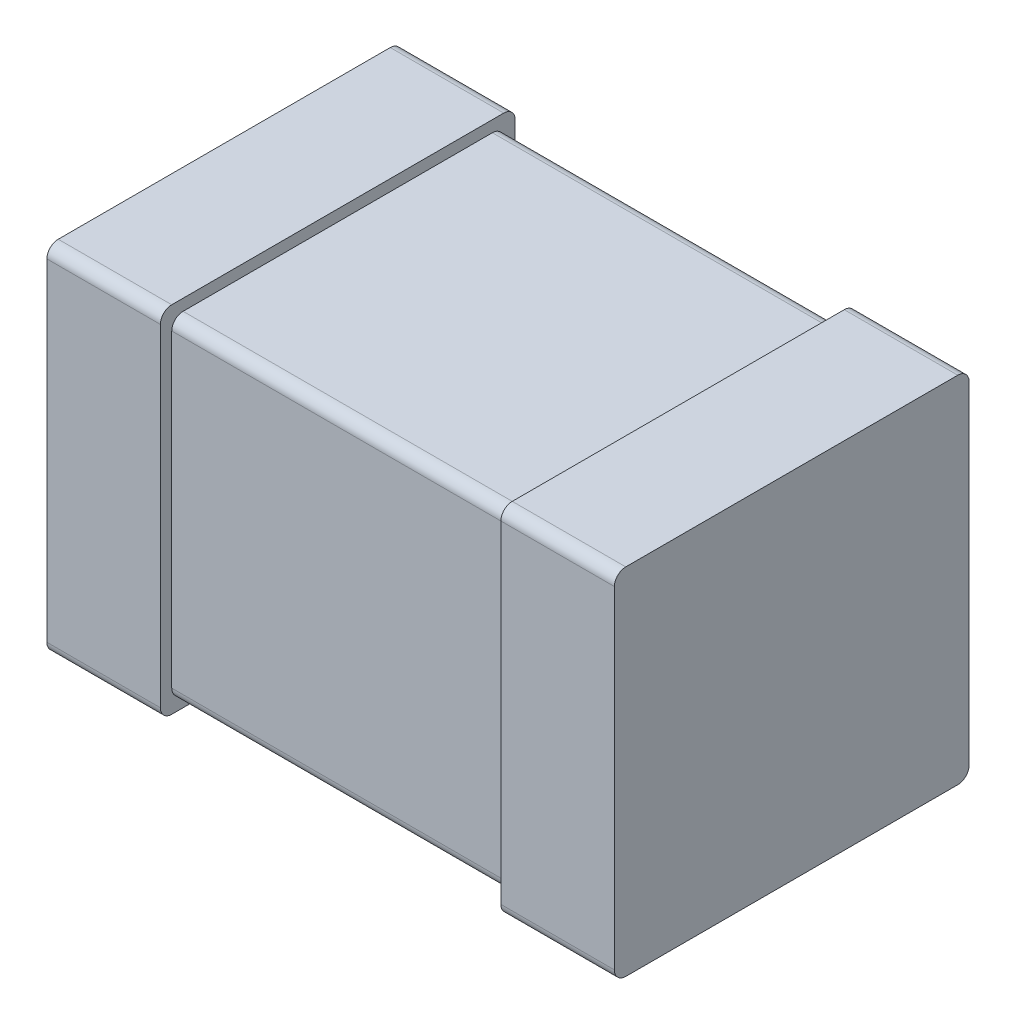
ISO-10303-21;
HEADER;
FILE_DESCRIPTION(('STEP AP214'),'2;1');
FILE_NAME('part.step','',(''),(''),'','','');
FILE_SCHEMA(('AUTOMOTIVE_DESIGN { 1 0 10303 214 1 1 1 1 }'));
ENDSEC;
DATA;
#1=APPLICATION_CONTEXT('core data for automotive mechanical design processes');
#2=APPLICATION_PROTOCOL_DEFINITION('international standard','automotive_design',2000,#1);
#3=PRODUCT_CONTEXT('',#1,'mechanical');
#4=PRODUCT('Part','Part','',(#3));
#5=PRODUCT_RELATED_PRODUCT_CATEGORY('part','',(#4));
#6=PRODUCT_DEFINITION_FORMATION('','',#4);
#7=PRODUCT_DEFINITION_CONTEXT('part definition',#1,'design');
#8=PRODUCT_DEFINITION('design','',#6,#7);
#9=PRODUCT_DEFINITION_SHAPE('','',#8);
#10=(LENGTH_UNIT() NAMED_UNIT(*) SI_UNIT(.MILLI.,.METRE.));
#11=(NAMED_UNIT(*) PLANE_ANGLE_UNIT() SI_UNIT($,.RADIAN.));
#12=(NAMED_UNIT(*) SI_UNIT($,.STERADIAN.) SOLID_ANGLE_UNIT());
#13=UNCERTAINTY_MEASURE_WITH_UNIT(LENGTH_MEASURE(1.E-05),#10,'distance_accuracy_value','');
#14=(GEOMETRIC_REPRESENTATION_CONTEXT(3) GLOBAL_UNCERTAINTY_ASSIGNED_CONTEXT((#13)) GLOBAL_UNIT_ASSIGNED_CONTEXT((#10,
#11,#12)) REPRESENTATION_CONTEXT('',''));
#15=CARTESIAN_POINT('',(0.,0.,0.));
#16=DIRECTION('',(0.,0.,1.));
#17=DIRECTION('',(1.,0.,0.));
#18=AXIS2_PLACEMENT_3D('',#15,#16,#17);
#19=CARTESIAN_POINT('',(-1.,-0.625,0.));
#20=DIRECTION('',(1.,0.,0.));
#21=DIRECTION('',(0.,1.,0.));
#22=AXIS2_PLACEMENT_3D('',#19,#20,#21);
#23=PLANE('',#22);
#24=CARTESIAN_POINT('',(-1.,-0.585,1.21));
#25=DIRECTION('',(-1.,0.,0.));
#26=DIRECTION('',(0.,0.,1.));
#27=AXIS2_PLACEMENT_3D('',#24,#25,#26);
#28=CIRCLE('',#27,0.04);
#29=CARTESIAN_POINT('',(-1.,-0.625,1.21));
#30=VERTEX_POINT('',#29);
#31=CARTESIAN_POINT('',(-1.,-0.585,1.25));
#32=VERTEX_POINT('',#31);
#33=EDGE_CURVE('E11',#30,#32,#28,.T.);
#34=ORIENTED_EDGE('',*,*,#33,.T.);
#35=DIRECTION('',(0.,1.,0.));
#36=VECTOR('',#35,1.);
#37=CARTESIAN_POINT('',(-1.,-0.625,1.25));
#38=LINE('',#37,#36);
#39=CARTESIAN_POINT('',(-1.,0.585,1.25));
#40=VERTEX_POINT('',#39);
#41=EDGE_CURVE('E27',#32,#40,#38,.T.);
#42=ORIENTED_EDGE('',*,*,#41,.T.);
#43=CARTESIAN_POINT('',(-1.,0.585,1.21));
#44=DIRECTION('',(1.,0.,0.));
#45=DIRECTION('',(0.,0.,1.));
#46=AXIS2_PLACEMENT_3D('',#43,#44,#45);
#47=CIRCLE('',#46,0.04);
#48=CARTESIAN_POINT('',(-1.,0.625,1.21));
#49=VERTEX_POINT('',#48);
#50=EDGE_CURVE('E290',#49,#40,#47,.T.);
#51=ORIENTED_EDGE('',*,*,#50,.F.);
#52=DIRECTION('',(0.,0.,1.));
#53=VECTOR('',#52,1.);
#54=CARTESIAN_POINT('',(-1.,0.625,0.));
#55=LINE('',#54,#53);
#56=CARTESIAN_POINT('',(-1.,0.625,0.04));
#57=VERTEX_POINT('',#56);
#58=EDGE_CURVE('E332',#57,#49,#55,.T.);
#59=ORIENTED_EDGE('',*,*,#58,.F.);
#60=CARTESIAN_POINT('',(-1.,0.585,0.04));
#61=DIRECTION('',(-1.,0.,0.));
#62=DIRECTION('',(0.,0.,1.));
#63=AXIS2_PLACEMENT_3D('',#60,#61,#62);
#64=CIRCLE('',#63,0.04);
#65=CARTESIAN_POINT('',(-1.,0.585,0.));
#66=VERTEX_POINT('',#65);
#67=EDGE_CURVE('E268',#57,#66,#64,.T.);
#68=ORIENTED_EDGE('',*,*,#67,.T.);
#69=DIRECTION('',(0.,1.,0.));
#70=VECTOR('',#69,1.);
#71=CARTESIAN_POINT('',(-1.,-0.625,0.));
#72=LINE('',#71,#70);
#73=CARTESIAN_POINT('',(-1.,-0.585,0.));
#74=VERTEX_POINT('',#73);
#75=EDGE_CURVE('E298',#74,#66,#72,.T.);
#76=ORIENTED_EDGE('',*,*,#75,.F.);
#77=CARTESIAN_POINT('',(-1.,-0.585,0.04));
#78=DIRECTION('',(1.,0.,0.));
#79=DIRECTION('',(0.,0.,1.));
#80=AXIS2_PLACEMENT_3D('',#77,#78,#79);
#81=CIRCLE('',#80,0.04);
#82=CARTESIAN_POINT('',(-1.,-0.625,0.04));
#83=VERTEX_POINT('',#82);
#84=EDGE_CURVE('E284',#83,#74,#81,.T.);
#85=ORIENTED_EDGE('',*,*,#84,.F.);
#86=DIRECTION('',(0.,0.,1.));
#87=VECTOR('',#86,1.);
#88=CARTESIAN_POINT('',(-1.,-0.625,0.));
#89=LINE('',#88,#87);
#90=EDGE_CURVE('E264',#83,#30,#89,.T.);
#91=ORIENTED_EDGE('',*,*,#90,.T.);
#92=EDGE_LOOP('',(#34,#42,#51,#59,#68,#76,#85,#91));
#93=FACE_BOUND('',#92,.T.);
#94=ADVANCED_FACE('F16',(#93),#23,.F.);
#95=CARTESIAN_POINT('',(-1.,-0.625,0.));
#96=DIRECTION('',(0.,1.,0.));
#97=DIRECTION('',(1.,0.,0.));
#98=AXIS2_PLACEMENT_3D('',#95,#96,#97);
#99=PLANE('',#98);
#100=DIRECTION('',(1.,0.,0.));
#101=VECTOR('',#100,1.);
#102=CARTESIAN_POINT('',(-1.,-0.625,1.21));
#103=LINE('',#102,#101);
#104=CARTESIAN_POINT('',(-0.6,-0.625,1.21));
#105=VERTEX_POINT('',#104);
#106=EDGE_CURVE('E306',#30,#105,#103,.T.);
#107=ORIENTED_EDGE('',*,*,#106,.F.);
#108=ORIENTED_EDGE('',*,*,#90,.F.);
#109=DIRECTION('',(1.,0.,0.));
#110=VECTOR('',#109,1.);
#111=CARTESIAN_POINT('',(-1.,-0.625,0.04));
#112=LINE('',#111,#110);
#113=CARTESIAN_POINT('',(-0.6,-0.625,0.04));
#114=VERTEX_POINT('',#113);
#115=EDGE_CURVE('E269',#83,#114,#112,.T.);
#116=ORIENTED_EDGE('',*,*,#115,.T.);
#117=DIRECTION('',(0.,0.,1.));
#118=VECTOR('',#117,1.);
#119=CARTESIAN_POINT('',(-0.6,-0.625,0.));
#120=LINE('',#119,#118);
#121=EDGE_CURVE('E288',#114,#105,#120,.T.);
#122=ORIENTED_EDGE('',*,*,#121,.T.);
#123=EDGE_LOOP('',(#107,#108,#116,#122));
#124=FACE_BOUND('',#123,.T.);
#125=ADVANCED_FACE('F423',(#124),#99,.F.);
#126=CARTESIAN_POINT('',(-1.,-0.585,0.04));
#127=DIRECTION('',(1.,0.,0.));
#128=DIRECTION('',(0.,-1.,0.));
#129=AXIS2_PLACEMENT_3D('',#126,#127,#128);
#130=CYLINDRICAL_SURFACE('',#129,0.04);
#131=ORIENTED_EDGE('',*,*,#84,.T.);
#132=DIRECTION('',(1.,0.,0.));
#133=VECTOR('',#132,1.);
#134=CARTESIAN_POINT('',(-1.,-0.585,0.));
#135=LINE('',#134,#133);
#136=CARTESIAN_POINT('',(-0.6,-0.585,0.));
#137=VERTEX_POINT('',#136);
#138=EDGE_CURVE('E289',#74,#137,#135,.T.);
#139=ORIENTED_EDGE('',*,*,#138,.T.);
#140=CARTESIAN_POINT('',(-0.6,-0.585,0.04));
#141=DIRECTION('',(1.,0.,0.));
#142=DIRECTION('',(0.,0.,1.));
#143=AXIS2_PLACEMENT_3D('',#140,#141,#142);
#144=CIRCLE('',#143,0.04);
#145=EDGE_CURVE('E330',#114,#137,#144,.T.);
#146=ORIENTED_EDGE('',*,*,#145,.F.);
#147=ORIENTED_EDGE('',*,*,#115,.F.);
#148=EDGE_LOOP('',(#131,#139,#146,#147));
#149=FACE_BOUND('',#148,.T.);
#150=ADVANCED_FACE('F409',(#149),#130,.T.);
#151=CARTESIAN_POINT('',(-1.,-0.585,1.21));
#152=DIRECTION('',(1.,0.,0.));
#153=DIRECTION('',(0.,-1.,0.));
#154=AXIS2_PLACEMENT_3D('',#151,#152,#153);
#155=CYLINDRICAL_SURFACE('',#154,0.04);
#156=ORIENTED_EDGE('',*,*,#106,.T.);
#157=CARTESIAN_POINT('',(-0.6,-0.585,1.21));
#158=DIRECTION('',(-1.,0.,0.));
#159=DIRECTION('',(0.,0.,1.));
#160=AXIS2_PLACEMENT_3D('',#157,#158,#159);
#161=CIRCLE('',#160,0.04);
#162=CARTESIAN_POINT('',(-0.6,-0.585,1.25));
#163=VERTEX_POINT('',#162);
#164=EDGE_CURVE('E303',#105,#163,#161,.T.);
#165=ORIENTED_EDGE('',*,*,#164,.T.);
#166=DIRECTION('',(1.,0.,0.));
#167=VECTOR('',#166,1.);
#168=CARTESIAN_POINT('',(-1.,-0.585,1.25));
#169=LINE('',#168,#167);
#170=EDGE_CURVE('E302',#32,#163,#169,.T.);
#171=ORIENTED_EDGE('',*,*,#170,.F.);
#172=ORIENTED_EDGE('',*,*,#33,.F.);
#173=EDGE_LOOP('',(#156,#165,#171,#172));
#174=FACE_BOUND('',#173,.T.);
#175=ADVANCED_FACE('F588',(#174),#155,.T.);
#176=CARTESIAN_POINT('',(-1.,-0.625,0.));
#177=DIRECTION('',(0.,0.,1.));
#178=DIRECTION('',(1.,0.,0.));
#179=AXIS2_PLACEMENT_3D('',#176,#177,#178);
#180=PLANE('',#179);
#181=DIRECTION('',(1.,0.,0.));
#182=VECTOR('',#181,1.);
#183=CARTESIAN_POINT('',(-1.,0.585,0.));
#184=LINE('',#183,#182);
#185=CARTESIAN_POINT('',(-0.6,0.585,0.));
#186=VERTEX_POINT('',#185);
#187=EDGE_CURVE('E301',#66,#186,#184,.T.);
#188=ORIENTED_EDGE('',*,*,#187,.T.);
#189=DIRECTION('',(0.,1.,0.));
#190=VECTOR('',#189,1.);
#191=CARTESIAN_POINT('',(-0.6,-0.625,0.));
#192=LINE('',#191,#190);
#193=EDGE_CURVE('E328',#137,#186,#192,.T.);
#194=ORIENTED_EDGE('',*,*,#193,.F.);
#195=ORIENTED_EDGE('',*,*,#138,.F.);
#196=ORIENTED_EDGE('',*,*,#75,.T.);
#197=EDGE_LOOP('',(#188,#194,#195,#196));
#198=FACE_BOUND('',#197,.T.);
#199=ADVANCED_FACE('F414',(#198),#180,.F.);
#200=CARTESIAN_POINT('',(-1.,-0.625,1.25));
#201=DIRECTION('',(0.,0.,1.));
#202=DIRECTION('',(1.,0.,0.));
#203=AXIS2_PLACEMENT_3D('',#200,#201,#202);
#204=PLANE('',#203);
#205=ORIENTED_EDGE('',*,*,#41,.F.);
#206=ORIENTED_EDGE('',*,*,#170,.T.);
#207=DIRECTION('',(0.,1.,0.));
#208=VECTOR('',#207,1.);
#209=CARTESIAN_POINT('',(-0.6,-0.625,1.25));
#210=LINE('',#209,#208);
#211=CARTESIAN_POINT('',(-0.6,0.585,1.25));
#212=VERTEX_POINT('',#211);
#213=EDGE_CURVE('E489',#163,#212,#210,.T.);
#214=ORIENTED_EDGE('',*,*,#213,.T.);
#215=DIRECTION('',(1.,0.,0.));
#216=VECTOR('',#215,1.);
#217=CARTESIAN_POINT('',(-1.,0.585,1.25));
#218=LINE('',#217,#216);
#219=EDGE_CURVE('E294',#40,#212,#218,.T.);
#220=ORIENTED_EDGE('',*,*,#219,.F.);
#221=EDGE_LOOP('',(#205,#206,#214,#220));
#222=FACE_BOUND('',#221,.T.);
#223=ADVANCED_FACE('F533',(#222),#204,.T.);
#224=CARTESIAN_POINT('',(-1.,0.585,0.04));
#225=DIRECTION('',(1.,0.,0.));
#226=DIRECTION('',(0.,1.,0.));
#227=AXIS2_PLACEMENT_3D('',#224,#225,#226);
#228=CYLINDRICAL_SURFACE('',#227,0.04);
#229=DIRECTION('',(1.,0.,0.));
#230=VECTOR('',#229,1.);
#231=CARTESIAN_POINT('',(-1.,0.625,0.04));
#232=LINE('',#231,#230);
#233=CARTESIAN_POINT('',(-0.6,0.625,0.04));
#234=VERTEX_POINT('',#233);
#235=EDGE_CURVE('E394',#57,#234,#232,.T.);
#236=ORIENTED_EDGE('',*,*,#235,.T.);
#237=CARTESIAN_POINT('',(-0.6,0.585,0.04));
#238=DIRECTION('',(-1.,0.,0.));
#239=DIRECTION('',(0.,0.,1.));
#240=AXIS2_PLACEMENT_3D('',#237,#238,#239);
#241=CIRCLE('',#240,0.04);
#242=EDGE_CURVE('E293',#234,#186,#241,.T.);
#243=ORIENTED_EDGE('',*,*,#242,.T.);
#244=ORIENTED_EDGE('',*,*,#187,.F.);
#245=ORIENTED_EDGE('',*,*,#67,.F.);
#246=EDGE_LOOP('',(#236,#243,#244,#245));
#247=FACE_BOUND('',#246,.T.);
#248=ADVANCED_FACE('F542',(#247),#228,.T.);
#249=CARTESIAN_POINT('',(-1.,0.585,1.21));
#250=DIRECTION('',(1.,0.,0.));
#251=DIRECTION('',(0.,1.,0.));
#252=AXIS2_PLACEMENT_3D('',#249,#250,#251);
#253=CYLINDRICAL_SURFACE('',#252,0.04);
#254=ORIENTED_EDGE('',*,*,#50,.T.);
#255=ORIENTED_EDGE('',*,*,#219,.T.);
#256=CARTESIAN_POINT('',(-0.6,0.585,1.21));
#257=DIRECTION('',(1.,0.,0.));
#258=DIRECTION('',(0.,0.,1.));
#259=AXIS2_PLACEMENT_3D('',#256,#257,#258);
#260=CIRCLE('',#259,0.04);
#261=CARTESIAN_POINT('',(-0.6,0.625,1.21));
#262=VERTEX_POINT('',#261);
#263=EDGE_CURVE('E214',#262,#212,#260,.T.);
#264=ORIENTED_EDGE('',*,*,#263,.F.);
#265=DIRECTION('',(1.,0.,0.));
#266=VECTOR('',#265,1.);
#267=CARTESIAN_POINT('',(-1.,0.625,1.21));
#268=LINE('',#267,#266);
#269=EDGE_CURVE('E335',#49,#262,#268,.T.);
#270=ORIENTED_EDGE('',*,*,#269,.F.);
#271=EDGE_LOOP('',(#254,#255,#264,#270));
#272=FACE_BOUND('',#271,.T.);
#273=ADVANCED_FACE('F535',(#272),#253,.T.);
#274=CARTESIAN_POINT('',(-1.,0.625,0.));
#275=DIRECTION('',(0.,1.,0.));
#276=DIRECTION('',(1.,0.,0.));
#277=AXIS2_PLACEMENT_3D('',#274,#275,#276);
#278=PLANE('',#277);
#279=DIRECTION('',(0.,0.,1.));
#280=VECTOR('',#279,1.);
#281=CARTESIAN_POINT('',(-0.6,0.625,0.));
#282=LINE('',#281,#280);
#283=EDGE_CURVE('E331',#234,#262,#282,.T.);
#284=ORIENTED_EDGE('',*,*,#283,.F.);
#285=ORIENTED_EDGE('',*,*,#235,.F.);
#286=ORIENTED_EDGE('',*,*,#58,.T.);
#287=ORIENTED_EDGE('',*,*,#269,.T.);
#288=EDGE_LOOP('',(#284,#285,#286,#287));
#289=FACE_BOUND('',#288,.T.);
#290=ADVANCED_FACE('F538',(#289),#278,.T.);
#291=CARTESIAN_POINT('',(-0.6,-0.625,0.));
#292=DIRECTION('',(1.,0.,0.));
#293=DIRECTION('',(0.,1.,0.));
#294=AXIS2_PLACEMENT_3D('',#291,#292,#293);
#295=PLANE('',#294);
#296=ORIENTED_EDGE('',*,*,#121,.F.);
#297=ORIENTED_EDGE('',*,*,#145,.T.);
#298=ORIENTED_EDGE('',*,*,#193,.T.);
#299=ORIENTED_EDGE('',*,*,#242,.F.);
#300=ORIENTED_EDGE('',*,*,#283,.T.);
#301=ORIENTED_EDGE('',*,*,#263,.T.);
#302=ORIENTED_EDGE('',*,*,#213,.F.);
#303=ORIENTED_EDGE('',*,*,#164,.F.);
#304=EDGE_LOOP('',(#296,#297,#298,#299,#300,#301,#302,#303));
#305=FACE_BOUND('',#304,.T.);
#306=CARTESIAN_POINT('',(-0.6,-0.545,0.08));
#307=DIRECTION('',(1.,0.,0.));
#308=DIRECTION('',(0.,0.,1.));
#309=AXIS2_PLACEMENT_3D('',#306,#307,#308);
#310=CIRCLE('',#309,0.04);
#311=CARTESIAN_POINT('',(-0.6,-0.585,0.08));
#312=VERTEX_POINT('',#311);
#313=CARTESIAN_POINT('',(-0.6,-0.545,0.04));
#314=VERTEX_POINT('',#313);
#315=EDGE_CURVE('E187',#312,#314,#310,.T.);
#316=ORIENTED_EDGE('',*,*,#315,.F.);
#317=DIRECTION('',(0.,0.,1.));
#318=VECTOR('',#317,1.);
#319=CARTESIAN_POINT('',(-0.6,-0.585,0.04));
#320=LINE('',#319,#318);
#321=CARTESIAN_POINT('',(-0.6,-0.585,1.17));
#322=VERTEX_POINT('',#321);
#323=EDGE_CURVE('E191',#312,#322,#320,.T.);
#324=ORIENTED_EDGE('',*,*,#323,.T.);
#325=CARTESIAN_POINT('',(-0.6,-0.545,1.17));
#326=DIRECTION('',(-1.,0.,0.));
#327=DIRECTION('',(0.,0.,1.));
#328=AXIS2_PLACEMENT_3D('',#325,#326,#327);
#329=CIRCLE('',#328,0.04);
#330=CARTESIAN_POINT('',(-0.6,-0.545,1.21));
#331=VERTEX_POINT('',#330);
#332=EDGE_CURVE('E215',#322,#331,#329,.T.);
#333=ORIENTED_EDGE('',*,*,#332,.T.);
#334=DIRECTION('',(0.,1.,0.));
#335=VECTOR('',#334,1.);
#336=CARTESIAN_POINT('',(-0.6,-0.585,1.21));
#337=LINE('',#336,#335);
#338=CARTESIAN_POINT('',(-0.6,0.545,1.21));
#339=VERTEX_POINT('',#338);
#340=EDGE_CURVE('E260',#331,#339,#337,.T.);
#341=ORIENTED_EDGE('',*,*,#340,.T.);
#342=CARTESIAN_POINT('',(-0.6,0.545,1.17));
#343=DIRECTION('',(1.,0.,0.));
#344=DIRECTION('',(0.,0.,1.));
#345=AXIS2_PLACEMENT_3D('',#342,#343,#344);
#346=CIRCLE('',#345,0.04);
#347=CARTESIAN_POINT('',(-0.6,0.585,1.17));
#348=VERTEX_POINT('',#347);
#349=EDGE_CURVE('E278',#348,#339,#346,.T.);
#350=ORIENTED_EDGE('',*,*,#349,.F.);
#351=DIRECTION('',(0.,0.,1.));
#352=VECTOR('',#351,1.);
#353=CARTESIAN_POINT('',(-0.6,0.585,0.04));
#354=LINE('',#353,#352);
#355=CARTESIAN_POINT('',(-0.6,0.585,0.08));
#356=VERTEX_POINT('',#355);
#357=EDGE_CURVE('E20',#356,#348,#354,.T.);
#358=ORIENTED_EDGE('',*,*,#357,.F.);
#359=CARTESIAN_POINT('',(-0.6,0.545,0.08));
#360=DIRECTION('',(-1.,0.,0.));
#361=DIRECTION('',(0.,0.,1.));
#362=AXIS2_PLACEMENT_3D('',#359,#360,#361);
#363=CIRCLE('',#362,0.04);
#364=CARTESIAN_POINT('',(-0.6,0.545,0.04));
#365=VERTEX_POINT('',#364);
#366=EDGE_CURVE('E201',#356,#365,#363,.T.);
#367=ORIENTED_EDGE('',*,*,#366,.T.);
#368=DIRECTION('',(0.,1.,0.));
#369=VECTOR('',#368,1.);
#370=CARTESIAN_POINT('',(-0.6,-0.585,0.04));
#371=LINE('',#370,#369);
#372=EDGE_CURVE('E195',#314,#365,#371,.T.);
#373=ORIENTED_EDGE('',*,*,#372,.F.);
#374=EDGE_LOOP('',(#316,#324,#333,#341,#350,#358,#367,#373));
#375=FACE_BOUND('',#374,.T.);
#376=ADVANCED_FACE('F189',(#305,#375),#295,.T.);
#377=CARTESIAN_POINT('',(-0.6,-0.545,0.08));
#378=DIRECTION('',(1.,0.,0.));
#379=DIRECTION('',(0.,-1.,0.));
#380=AXIS2_PLACEMENT_3D('',#377,#378,#379);
#381=CYLINDRICAL_SURFACE('',#380,0.04);
#382=ORIENTED_EDGE('',*,*,#315,.T.);
#383=DIRECTION('',(1.,0.,0.));
#384=VECTOR('',#383,1.);
#385=CARTESIAN_POINT('',(-0.6,-0.545,0.04));
#386=LINE('',#385,#384);
#387=CARTESIAN_POINT('',(0.6,-0.545,0.04));
#388=VERTEX_POINT('',#387);
#389=EDGE_CURVE('E202',#314,#388,#386,.T.);
#390=ORIENTED_EDGE('',*,*,#389,.T.);
#391=CARTESIAN_POINT('',(0.6,-0.545,0.08));
#392=DIRECTION('',(1.,0.,0.));
#393=DIRECTION('',(0.,0.,1.));
#394=AXIS2_PLACEMENT_3D('',#391,#392,#393);
#395=CIRCLE('',#394,0.04);
#396=CARTESIAN_POINT('',(0.6,-0.585,0.08));
#397=VERTEX_POINT('',#396);
#398=EDGE_CURVE('E220',#397,#388,#395,.T.);
#399=ORIENTED_EDGE('',*,*,#398,.F.);
#400=DIRECTION('',(1.,0.,0.));
#401=VECTOR('',#400,1.);
#402=CARTESIAN_POINT('',(-0.6,-0.585,0.08));
#403=LINE('',#402,#401);
#404=EDGE_CURVE('E209',#312,#397,#403,.T.);
#405=ORIENTED_EDGE('',*,*,#404,.F.);
#406=EDGE_LOOP('',(#382,#390,#399,#405));
#407=FACE_BOUND('',#406,.T.);
#408=ADVANCED_FACE('F218',(#407),#381,.T.);
#409=CARTESIAN_POINT('',(-0.6,-0.585,0.04));
#410=DIRECTION('',(0.,0.,1.));
#411=DIRECTION('',(1.,0.,0.));
#412=AXIS2_PLACEMENT_3D('',#409,#410,#411);
#413=PLANE('',#412);
#414=DIRECTION('',(1.,0.,0.));
#415=VECTOR('',#414,1.);
#416=CARTESIAN_POINT('',(-0.6,0.545,0.04));
#417=LINE('',#416,#415);
#418=CARTESIAN_POINT('',(0.6,0.545,0.04));
#419=VERTEX_POINT('',#418);
#420=EDGE_CURVE('E257',#365,#419,#417,.T.);
#421=ORIENTED_EDGE('',*,*,#420,.T.);
#422=DIRECTION('',(0.,1.,0.));
#423=VECTOR('',#422,1.);
#424=CARTESIAN_POINT('',(0.6,-0.585,0.04));
#425=LINE('',#424,#423);
#426=EDGE_CURVE('E382',#388,#419,#425,.T.);
#427=ORIENTED_EDGE('',*,*,#426,.F.);
#428=ORIENTED_EDGE('',*,*,#389,.F.);
#429=ORIENTED_EDGE('',*,*,#372,.T.);
#430=EDGE_LOOP('',(#421,#427,#428,#429));
#431=FACE_BOUND('',#430,.T.);
#432=ADVANCED_FACE('F622',(#431),#413,.F.);
#433=CARTESIAN_POINT('',(-0.6,0.545,0.08));
#434=DIRECTION('',(1.,0.,0.));
#435=DIRECTION('',(0.,1.,0.));
#436=AXIS2_PLACEMENT_3D('',#433,#434,#435);
#437=CYLINDRICAL_SURFACE('',#436,0.04);
#438=DIRECTION('',(1.,0.,0.));
#439=VECTOR('',#438,1.);
#440=CARTESIAN_POINT('',(-0.6,0.585,0.08));
#441=LINE('',#440,#439);
#442=CARTESIAN_POINT('',(0.6,0.585,0.08));
#443=VERTEX_POINT('',#442);
#444=EDGE_CURVE('E236',#356,#443,#441,.T.);
#445=ORIENTED_EDGE('',*,*,#444,.T.);
#446=CARTESIAN_POINT('',(0.6,0.545,0.08));
#447=DIRECTION('',(-1.,0.,0.));
#448=DIRECTION('',(0.,0.,1.));
#449=AXIS2_PLACEMENT_3D('',#446,#447,#448);
#450=CIRCLE('',#449,0.04);
#451=EDGE_CURVE('E248',#443,#419,#450,.T.);
#452=ORIENTED_EDGE('',*,*,#451,.T.);
#453=ORIENTED_EDGE('',*,*,#420,.F.);
#454=ORIENTED_EDGE('',*,*,#366,.F.);
#455=EDGE_LOOP('',(#445,#452,#453,#454));
#456=FACE_BOUND('',#455,.T.);
#457=ADVANCED_FACE('F598',(#456),#437,.T.);
#458=CARTESIAN_POINT('',(-0.6,0.585,0.04));
#459=DIRECTION('',(0.,1.,0.));
#460=DIRECTION('',(1.,0.,0.));
#461=AXIS2_PLACEMENT_3D('',#458,#459,#460);
#462=PLANE('',#461);
#463=DIRECTION('',(0.,0.,1.));
#464=VECTOR('',#463,1.);
#465=CARTESIAN_POINT('',(0.6,0.585,0.04));
#466=LINE('',#465,#464);
#467=CARTESIAN_POINT('',(0.6,0.585,1.17));
#468=VERTEX_POINT('',#467);
#469=EDGE_CURVE('E263',#443,#468,#466,.T.);
#470=ORIENTED_EDGE('',*,*,#469,.F.);
#471=ORIENTED_EDGE('',*,*,#444,.F.);
#472=ORIENTED_EDGE('',*,*,#357,.T.);
#473=DIRECTION('',(1.,0.,0.));
#474=VECTOR('',#473,1.);
#475=CARTESIAN_POINT('',(-0.6,0.585,1.17));
#476=LINE('',#475,#474);
#477=EDGE_CURVE('E282',#348,#468,#476,.T.);
#478=ORIENTED_EDGE('',*,*,#477,.T.);
#479=EDGE_LOOP('',(#470,#471,#472,#478));
#480=FACE_BOUND('',#479,.T.);
#481=ADVANCED_FACE('F572',(#480),#462,.T.);
#482=CARTESIAN_POINT('',(-0.6,0.545,1.17));
#483=DIRECTION('',(1.,0.,0.));
#484=DIRECTION('',(0.,1.,0.));
#485=AXIS2_PLACEMENT_3D('',#482,#483,#484);
#486=CYLINDRICAL_SURFACE('',#485,0.04);
#487=ORIENTED_EDGE('',*,*,#349,.T.);
#488=DIRECTION('',(1.,0.,0.));
#489=VECTOR('',#488,1.);
#490=CARTESIAN_POINT('',(-0.6,0.545,1.21));
#491=LINE('',#490,#489);
#492=CARTESIAN_POINT('',(0.6,0.545,1.21));
#493=VERTEX_POINT('',#492);
#494=EDGE_CURVE('E283',#339,#493,#491,.T.);
#495=ORIENTED_EDGE('',*,*,#494,.T.);
#496=CARTESIAN_POINT('',(0.6,0.545,1.17));
#497=DIRECTION('',(1.,0.,0.));
#498=DIRECTION('',(0.,0.,1.));
#499=AXIS2_PLACEMENT_3D('',#496,#497,#498);
#500=CIRCLE('',#499,0.04);
#501=EDGE_CURVE('E163',#468,#493,#500,.T.);
#502=ORIENTED_EDGE('',*,*,#501,.F.);
#503=ORIENTED_EDGE('',*,*,#477,.F.);
#504=EDGE_LOOP('',(#487,#495,#502,#503));
#505=FACE_BOUND('',#504,.T.);
#506=ADVANCED_FACE('F568',(#505),#486,.T.);
#507=CARTESIAN_POINT('',(-0.6,-0.585,1.21));
#508=DIRECTION('',(0.,0.,1.));
#509=DIRECTION('',(1.,0.,0.));
#510=AXIS2_PLACEMENT_3D('',#507,#508,#509);
#511=PLANE('',#510);
#512=ORIENTED_EDGE('',*,*,#340,.F.);
#513=DIRECTION('',(1.,0.,0.));
#514=VECTOR('',#513,1.);
#515=CARTESIAN_POINT('',(-0.6,-0.545,1.21));
#516=LINE('',#515,#514);
#517=CARTESIAN_POINT('',(0.6,-0.545,1.21));
#518=VERTEX_POINT('',#517);
#519=EDGE_CURVE('E371',#331,#518,#516,.T.);
#520=ORIENTED_EDGE('',*,*,#519,.T.);
#521=DIRECTION('',(0.,1.,0.));
#522=VECTOR('',#521,1.);
#523=CARTESIAN_POINT('',(0.6,-0.585,1.21));
#524=LINE('',#523,#522);
#525=EDGE_CURVE('E153',#518,#493,#524,.T.);
#526=ORIENTED_EDGE('',*,*,#525,.T.);
#527=ORIENTED_EDGE('',*,*,#494,.F.);
#528=EDGE_LOOP('',(#512,#520,#526,#527));
#529=FACE_BOUND('',#528,.T.);
#530=ADVANCED_FACE('F571',(#529),#511,.T.);
#531=CARTESIAN_POINT('',(-0.6,-0.545,1.17));
#532=DIRECTION('',(1.,0.,0.));
#533=DIRECTION('',(0.,-1.,0.));
#534=AXIS2_PLACEMENT_3D('',#531,#532,#533);
#535=CYLINDRICAL_SURFACE('',#534,0.04);
#536=DIRECTION('',(1.,0.,0.));
#537=VECTOR('',#536,1.);
#538=CARTESIAN_POINT('',(-0.6,-0.585,1.17));
#539=LINE('',#538,#537);
#540=CARTESIAN_POINT('',(0.6,-0.585,1.17));
#541=VERTEX_POINT('',#540);
#542=EDGE_CURVE('E212',#322,#541,#539,.T.);
#543=ORIENTED_EDGE('',*,*,#542,.T.);
#544=CARTESIAN_POINT('',(0.6,-0.545,1.17));
#545=DIRECTION('',(-1.,0.,0.));
#546=DIRECTION('',(0.,0.,1.));
#547=AXIS2_PLACEMENT_3D('',#544,#545,#546);
#548=CIRCLE('',#547,0.04);
#549=EDGE_CURVE('E222',#541,#518,#548,.T.);
#550=ORIENTED_EDGE('',*,*,#549,.T.);
#551=ORIENTED_EDGE('',*,*,#519,.F.);
#552=ORIENTED_EDGE('',*,*,#332,.F.);
#553=EDGE_LOOP('',(#543,#550,#551,#552));
#554=FACE_BOUND('',#553,.T.);
#555=ADVANCED_FACE('F580',(#554),#535,.T.);
#556=CARTESIAN_POINT('',(-0.6,-0.585,0.04));
#557=DIRECTION('',(0.,1.,0.));
#558=DIRECTION('',(1.,0.,0.));
#559=AXIS2_PLACEMENT_3D('',#556,#557,#558);
#560=PLANE('',#559);
#561=ORIENTED_EDGE('',*,*,#542,.F.);
#562=ORIENTED_EDGE('',*,*,#323,.F.);
#563=ORIENTED_EDGE('',*,*,#404,.T.);
#564=DIRECTION('',(0.,0.,1.));
#565=VECTOR('',#564,1.);
#566=CARTESIAN_POINT('',(0.6,-0.585,0.04));
#567=LINE('',#566,#565);
#568=EDGE_CURVE('E223',#397,#541,#567,.T.);
#569=ORIENTED_EDGE('',*,*,#568,.T.);
#570=EDGE_LOOP('',(#561,#562,#563,#569));
#571=FACE_BOUND('',#570,.T.);
#572=ADVANCED_FACE('F206',(#571),#560,.F.);
#573=CARTESIAN_POINT('',(0.6,-0.625,0.));
#574=DIRECTION('',(1.,0.,0.));
#575=DIRECTION('',(0.,1.,0.));
#576=AXIS2_PLACEMENT_3D('',#573,#574,#575);
#577=PLANE('',#576);
#578=CARTESIAN_POINT('',(0.6,-0.585,1.21));
#579=DIRECTION('',(-1.,0.,0.));
#580=DIRECTION('',(0.,0.,1.));
#581=AXIS2_PLACEMENT_3D('',#578,#579,#580);
#582=CIRCLE('',#581,0.04);
#583=CARTESIAN_POINT('',(0.6,-0.625,1.21));
#584=VERTEX_POINT('',#583);
#585=CARTESIAN_POINT('',(0.6,-0.585,1.25));
#586=VERTEX_POINT('',#585);
#587=EDGE_CURVE('E232',#584,#586,#582,.T.);
#588=ORIENTED_EDGE('',*,*,#587,.T.);
#589=DIRECTION('',(0.,1.,0.));
#590=VECTOR('',#589,1.);
#591=CARTESIAN_POINT('',(0.6,-0.625,1.25));
#592=LINE('',#591,#590);
#593=CARTESIAN_POINT('',(0.6,0.585,1.25));
#594=VERTEX_POINT('',#593);
#595=EDGE_CURVE('E345',#586,#594,#592,.T.);
#596=ORIENTED_EDGE('',*,*,#595,.T.);
#597=CARTESIAN_POINT('',(0.6,0.585,1.21));
#598=DIRECTION('',(1.,0.,0.));
#599=DIRECTION('',(0.,0.,1.));
#600=AXIS2_PLACEMENT_3D('',#597,#598,#599);
#601=CIRCLE('',#600,0.04);
#602=CARTESIAN_POINT('',(0.6,0.625,1.21));
#603=VERTEX_POINT('',#602);
#604=EDGE_CURVE('E243',#603,#594,#601,.T.);
#605=ORIENTED_EDGE('',*,*,#604,.F.);
#606=DIRECTION('',(0.,0.,1.));
#607=VECTOR('',#606,1.);
#608=CARTESIAN_POINT('',(0.6,0.625,0.));
#609=LINE('',#608,#607);
#610=CARTESIAN_POINT('',(0.6,0.625,0.04));
#611=VERTEX_POINT('',#610);
#612=EDGE_CURVE('E253',#611,#603,#609,.T.);
#613=ORIENTED_EDGE('',*,*,#612,.F.);
#614=CARTESIAN_POINT('',(0.6,0.585,0.04));
#615=DIRECTION('',(-1.,0.,0.));
#616=DIRECTION('',(0.,0.,1.));
#617=AXIS2_PLACEMENT_3D('',#614,#615,#616);
#618=CIRCLE('',#617,0.04);
#619=CARTESIAN_POINT('',(0.6,0.585,0.));
#620=VERTEX_POINT('',#619);
#621=EDGE_CURVE('E341',#611,#620,#618,.T.);
#622=ORIENTED_EDGE('',*,*,#621,.T.);
#623=DIRECTION('',(0.,1.,0.));
#624=VECTOR('',#623,1.);
#625=CARTESIAN_POINT('',(0.6,-0.625,0.));
#626=LINE('',#625,#624);
#627=CARTESIAN_POINT('',(0.6,-0.585,0.));
#628=VERTEX_POINT('',#627);
#629=EDGE_CURVE('E472',#628,#620,#626,.T.);
#630=ORIENTED_EDGE('',*,*,#629,.F.);
#631=CARTESIAN_POINT('',(0.6,-0.585,0.04));
#632=DIRECTION('',(1.,0.,0.));
#633=DIRECTION('',(0.,0.,1.));
#634=AXIS2_PLACEMENT_3D('',#631,#632,#633);
#635=CIRCLE('',#634,0.04);
#636=CARTESIAN_POINT('',(0.6,-0.625,0.04));
#637=VERTEX_POINT('',#636);
#638=EDGE_CURVE('E241',#637,#628,#635,.T.);
#639=ORIENTED_EDGE('',*,*,#638,.F.);
#640=DIRECTION('',(0.,0.,1.));
#641=VECTOR('',#640,1.);
#642=CARTESIAN_POINT('',(0.6,-0.625,0.));
#643=LINE('',#642,#641);
#644=EDGE_CURVE('E346',#637,#584,#643,.T.);
#645=ORIENTED_EDGE('',*,*,#644,.T.);
#646=EDGE_LOOP('',(#588,#596,#605,#613,#622,#630,#639,#645));
#647=FACE_BOUND('',#646,.T.);
#648=ORIENTED_EDGE('',*,*,#426,.T.);
#649=ORIENTED_EDGE('',*,*,#451,.F.);
#650=ORIENTED_EDGE('',*,*,#469,.T.);
#651=ORIENTED_EDGE('',*,*,#501,.T.);
#652=ORIENTED_EDGE('',*,*,#525,.F.);
#653=ORIENTED_EDGE('',*,*,#549,.F.);
#654=ORIENTED_EDGE('',*,*,#568,.F.);
#655=ORIENTED_EDGE('',*,*,#398,.T.);
#656=EDGE_LOOP('',(#648,#649,#650,#651,#652,#653,#654,#655));
#657=FACE_BOUND('',#656,.T.);
#658=ADVANCED_FACE('F566',(#647,#657),#577,.F.);
#659=CARTESIAN_POINT('',(0.6,-0.625,0.));
#660=DIRECTION('',(0.,1.,0.));
#661=DIRECTION('',(1.,0.,0.));
#662=AXIS2_PLACEMENT_3D('',#659,#660,#661);
#663=PLANE('',#662);
#664=DIRECTION('',(1.,0.,0.));
#665=VECTOR('',#664,1.);
#666=CARTESIAN_POINT('',(0.6,-0.625,1.21));
#667=LINE('',#666,#665);
#668=CARTESIAN_POINT('',(1.,-0.625,1.21));
#669=VERTEX_POINT('',#668);
#670=EDGE_CURVE('E242',#584,#669,#667,.T.);
#671=ORIENTED_EDGE('',*,*,#670,.F.);
#672=ORIENTED_EDGE('',*,*,#644,.F.);
#673=DIRECTION('',(1.,0.,0.));
#674=VECTOR('',#673,1.);
#675=CARTESIAN_POINT('',(0.6,-0.625,0.04));
#676=LINE('',#675,#674);
#677=CARTESIAN_POINT('',(1.,-0.625,0.04));
#678=VERTEX_POINT('',#677);
#679=EDGE_CURVE('E347',#637,#678,#676,.T.);
#680=ORIENTED_EDGE('',*,*,#679,.T.);
#681=DIRECTION('',(0.,0.,1.));
#682=VECTOR('',#681,1.);
#683=CARTESIAN_POINT('',(1.,-0.625,0.));
#684=LINE('',#683,#682);
#685=EDGE_CURVE('E350',#678,#669,#684,.T.);
#686=ORIENTED_EDGE('',*,*,#685,.T.);
#687=EDGE_LOOP('',(#671,#672,#680,#686));
#688=FACE_BOUND('',#687,.T.);
#689=ADVANCED_FACE('F563',(#688),#663,.F.);
#690=CARTESIAN_POINT('',(0.6,-0.585,0.04));
#691=DIRECTION('',(1.,0.,0.));
#692=DIRECTION('',(0.,-1.,0.));
#693=AXIS2_PLACEMENT_3D('',#690,#691,#692);
#694=CYLINDRICAL_SURFACE('',#693,0.04);
#695=ORIENTED_EDGE('',*,*,#638,.T.);
#696=DIRECTION('',(1.,0.,0.));
#697=VECTOR('',#696,1.);
#698=CARTESIAN_POINT('',(0.6,-0.585,0.));
#699=LINE('',#698,#697);
#700=CARTESIAN_POINT('',(1.,-0.585,0.));
#701=VERTEX_POINT('',#700);
#702=EDGE_CURVE('E238',#628,#701,#699,.T.);
#703=ORIENTED_EDGE('',*,*,#702,.T.);
#704=CARTESIAN_POINT('',(1.,-0.585,0.04));
#705=DIRECTION('',(1.,0.,0.));
#706=DIRECTION('',(0.,0.,1.));
#707=AXIS2_PLACEMENT_3D('',#704,#705,#706);
#708=CIRCLE('',#707,0.04);
#709=EDGE_CURVE('E369',#678,#701,#708,.T.);
#710=ORIENTED_EDGE('',*,*,#709,.F.);
#711=ORIENTED_EDGE('',*,*,#679,.F.);
#712=EDGE_LOOP('',(#695,#703,#710,#711));
#713=FACE_BOUND('',#712,.T.);
#714=ADVANCED_FACE('F18',(#713),#694,.T.);
#715=CARTESIAN_POINT('',(0.6,-0.585,1.21));
#716=DIRECTION('',(1.,0.,0.));
#717=DIRECTION('',(0.,-1.,0.));
#718=AXIS2_PLACEMENT_3D('',#715,#716,#717);
#719=CYLINDRICAL_SURFACE('',#718,0.04);
#720=ORIENTED_EDGE('',*,*,#670,.T.);
#721=CARTESIAN_POINT('',(1.,-0.585,1.21));
#722=DIRECTION('',(-1.,0.,0.));
#723=DIRECTION('',(0.,0.,1.));
#724=AXIS2_PLACEMENT_3D('',#721,#722,#723);
#725=CIRCLE('',#724,0.04);
#726=CARTESIAN_POINT('',(1.,-0.585,1.25));
#727=VERTEX_POINT('',#726);
#728=EDGE_CURVE('E360',#669,#727,#725,.T.);
#729=ORIENTED_EDGE('',*,*,#728,.T.);
#730=DIRECTION('',(1.,0.,0.));
#731=VECTOR('',#730,1.);
#732=CARTESIAN_POINT('',(0.6,-0.585,1.25));
#733=LINE('',#732,#731);
#734=EDGE_CURVE('E274',#586,#727,#733,.T.);
#735=ORIENTED_EDGE('',*,*,#734,.F.);
#736=ORIENTED_EDGE('',*,*,#587,.F.);
#737=EDGE_LOOP('',(#720,#729,#735,#736));
#738=FACE_BOUND('',#737,.T.);
#739=ADVANCED_FACE('F613',(#738),#719,.T.);
#740=CARTESIAN_POINT('',(0.6,-0.625,0.));
#741=DIRECTION('',(0.,0.,1.));
#742=DIRECTION('',(1.,0.,0.));
#743=AXIS2_PLACEMENT_3D('',#740,#741,#742);
#744=PLANE('',#743);
#745=DIRECTION('',(1.,0.,0.));
#746=VECTOR('',#745,1.);
#747=CARTESIAN_POINT('',(0.6,0.585,0.));
#748=LINE('',#747,#746);
#749=CARTESIAN_POINT('',(1.,0.585,0.));
#750=VERTEX_POINT('',#749);
#751=EDGE_CURVE('E364',#620,#750,#748,.T.);
#752=ORIENTED_EDGE('',*,*,#751,.T.);
#753=DIRECTION('',(0.,1.,0.));
#754=VECTOR('',#753,1.);
#755=CARTESIAN_POINT('',(1.,-0.625,0.));
#756=LINE('',#755,#754);
#757=EDGE_CURVE('E365',#701,#750,#756,.T.);
#758=ORIENTED_EDGE('',*,*,#757,.F.);
#759=ORIENTED_EDGE('',*,*,#702,.F.);
#760=ORIENTED_EDGE('',*,*,#629,.T.);
#761=EDGE_LOOP('',(#752,#758,#759,#760));
#762=FACE_BOUND('',#761,.T.);
#763=ADVANCED_FACE('F471',(#762),#744,.F.);
#764=CARTESIAN_POINT('',(0.6,-0.625,1.25));
#765=DIRECTION('',(0.,0.,1.));
#766=DIRECTION('',(1.,0.,0.));
#767=AXIS2_PLACEMENT_3D('',#764,#765,#766);
#768=PLANE('',#767);
#769=ORIENTED_EDGE('',*,*,#595,.F.);
#770=ORIENTED_EDGE('',*,*,#734,.T.);
#771=DIRECTION('',(0.,1.,0.));
#772=VECTOR('',#771,1.);
#773=CARTESIAN_POINT('',(1.,-0.625,1.25));
#774=LINE('',#773,#772);
#775=CARTESIAN_POINT('',(1.,0.585,1.25));
#776=VERTEX_POINT('',#775);
#777=EDGE_CURVE('E270',#727,#776,#774,.T.);
#778=ORIENTED_EDGE('',*,*,#777,.T.);
#779=DIRECTION('',(1.,0.,0.));
#780=VECTOR('',#779,1.);
#781=CARTESIAN_POINT('',(0.6,0.585,1.25));
#782=LINE('',#781,#780);
#783=EDGE_CURVE('E247',#594,#776,#782,.T.);
#784=ORIENTED_EDGE('',*,*,#783,.F.);
#785=EDGE_LOOP('',(#769,#770,#778,#784));
#786=FACE_BOUND('',#785,.T.);
#787=ADVANCED_FACE('F574',(#786),#768,.T.);
#788=CARTESIAN_POINT('',(0.6,0.585,0.04));
#789=DIRECTION('',(1.,0.,0.));
#790=DIRECTION('',(0.,1.,0.));
#791=AXIS2_PLACEMENT_3D('',#788,#789,#790);
#792=CYLINDRICAL_SURFACE('',#791,0.04);
#793=DIRECTION('',(1.,0.,0.));
#794=VECTOR('',#793,1.);
#795=CARTESIAN_POINT('',(0.6,0.625,0.04));
#796=LINE('',#795,#794);
#797=CARTESIAN_POINT('',(1.,0.625,0.04));
#798=VERTEX_POINT('',#797);
#799=EDGE_CURVE('E275',#611,#798,#796,.T.);
#800=ORIENTED_EDGE('',*,*,#799,.T.);
#801=CARTESIAN_POINT('',(1.,0.585,0.04));
#802=DIRECTION('',(-1.,0.,0.));
#803=DIRECTION('',(0.,0.,1.));
#804=AXIS2_PLACEMENT_3D('',#801,#802,#803);
#805=CIRCLE('',#804,0.04);
#806=EDGE_CURVE('E246',#798,#750,#805,.T.);
#807=ORIENTED_EDGE('',*,*,#806,.T.);
#808=ORIENTED_EDGE('',*,*,#751,.F.);
#809=ORIENTED_EDGE('',*,*,#621,.F.);
#810=EDGE_LOOP('',(#800,#807,#808,#809));
#811=FACE_BOUND('',#810,.T.);
#812=ADVANCED_FACE('F477',(#811),#792,.T.);
#813=CARTESIAN_POINT('',(0.6,0.585,1.21));
#814=DIRECTION('',(1.,0.,0.));
#815=DIRECTION('',(0.,1.,0.));
#816=AXIS2_PLACEMENT_3D('',#813,#814,#815);
#817=CYLINDRICAL_SURFACE('',#816,0.04);
#818=ORIENTED_EDGE('',*,*,#604,.T.);
#819=ORIENTED_EDGE('',*,*,#783,.T.);
#820=CARTESIAN_POINT('',(1.,0.585,1.21));
#821=DIRECTION('',(1.,0.,0.));
#822=DIRECTION('',(0.,0.,1.));
#823=AXIS2_PLACEMENT_3D('',#820,#821,#822);
#824=CIRCLE('',#823,0.04);
#825=CARTESIAN_POINT('',(1.,0.625,1.21));
#826=VERTEX_POINT('',#825);
#827=EDGE_CURVE('E377',#826,#776,#824,.T.);
#828=ORIENTED_EDGE('',*,*,#827,.F.);
#829=DIRECTION('',(1.,0.,0.));
#830=VECTOR('',#829,1.);
#831=CARTESIAN_POINT('',(0.6,0.625,1.21));
#832=LINE('',#831,#830);
#833=EDGE_CURVE('E386',#603,#826,#832,.T.);
#834=ORIENTED_EDGE('',*,*,#833,.F.);
#835=EDGE_LOOP('',(#818,#819,#828,#834));
#836=FACE_BOUND('',#835,.T.);
#837=ADVANCED_FACE('F592',(#836),#817,.T.);
#838=CARTESIAN_POINT('',(0.6,0.625,0.));
#839=DIRECTION('',(0.,1.,0.));
#840=DIRECTION('',(1.,0.,0.));
#841=AXIS2_PLACEMENT_3D('',#838,#839,#840);
#842=PLANE('',#841);
#843=DIRECTION('',(0.,0.,1.));
#844=VECTOR('',#843,1.);
#845=CARTESIAN_POINT('',(1.,0.625,0.));
#846=LINE('',#845,#844);
#847=EDGE_CURVE('E370',#798,#826,#846,.T.);
#848=ORIENTED_EDGE('',*,*,#847,.F.);
#849=ORIENTED_EDGE('',*,*,#799,.F.);
#850=ORIENTED_EDGE('',*,*,#612,.T.);
#851=ORIENTED_EDGE('',*,*,#833,.T.);
#852=EDGE_LOOP('',(#848,#849,#850,#851));
#853=FACE_BOUND('',#852,.T.);
#854=ADVANCED_FACE('F589',(#853),#842,.T.);
#855=CARTESIAN_POINT('',(1.,-0.625,0.));
#856=DIRECTION('',(1.,0.,0.));
#857=DIRECTION('',(0.,1.,0.));
#858=AXIS2_PLACEMENT_3D('',#855,#856,#857);
#859=PLANE('',#858);
#860=ORIENTED_EDGE('',*,*,#685,.F.);
#861=ORIENTED_EDGE('',*,*,#709,.T.);
#862=ORIENTED_EDGE('',*,*,#757,.T.);
#863=ORIENTED_EDGE('',*,*,#806,.F.);
#864=ORIENTED_EDGE('',*,*,#847,.T.);
#865=ORIENTED_EDGE('',*,*,#827,.T.);
#866=ORIENTED_EDGE('',*,*,#777,.F.);
#867=ORIENTED_EDGE('',*,*,#728,.F.);
#868=EDGE_LOOP('',(#860,#861,#862,#863,#864,#865,#866,#867));
#869=FACE_BOUND('',#868,.T.);
#870=ADVANCED_FACE('F464',(#869),#859,.T.);
#871=CLOSED_SHELL('',(#94,#125,#150,#175,#199,#223,#248,#273,#290,#376,#408,#432,#457,#481,#506,
#530,#555,#572,#658,#689,#714,#739,#763,#787,#812,#837,#854,#870));
#872=MANIFOLD_SOLID_BREP('B1',#871);
#873=ADVANCED_BREP_SHAPE_REPRESENTATION('',(#18,#872),#14);
#874=SHAPE_DEFINITION_REPRESENTATION(#9,#873);
ENDSEC;
END-ISO-10303-21;
